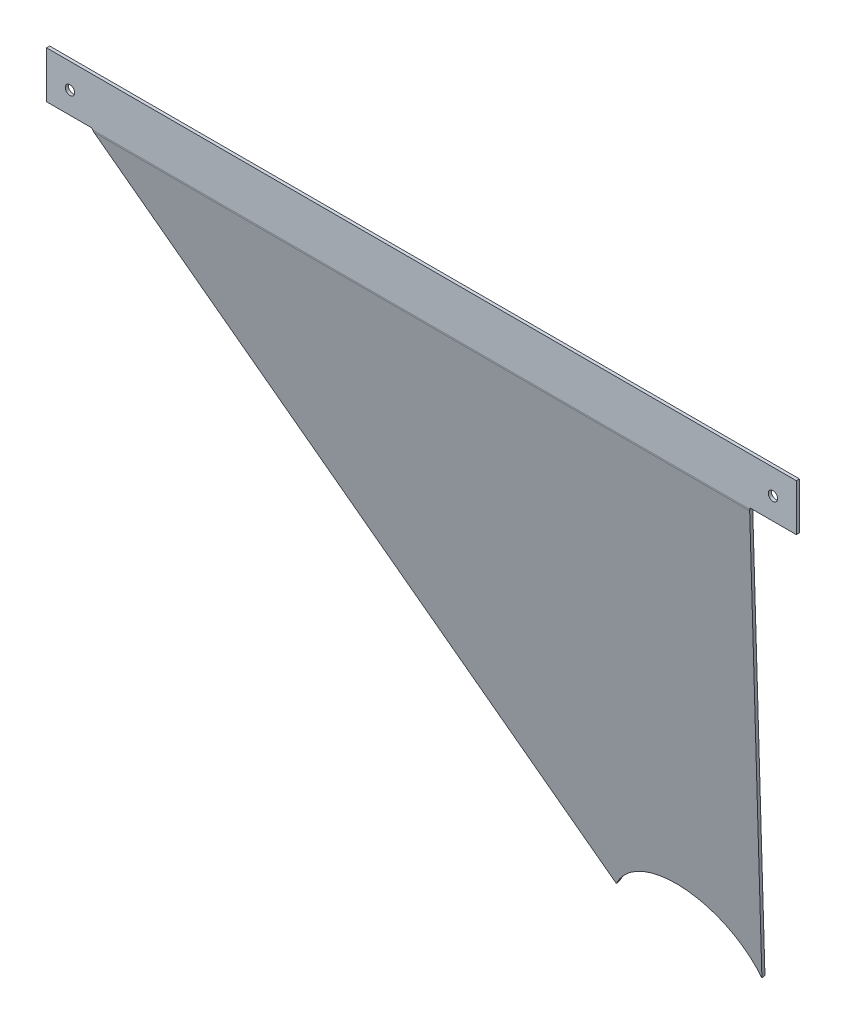
ISO-10303-21;
HEADER;
FILE_DESCRIPTION(('STEP AP214'),'2;1');
FILE_NAME('part.step','',(''),(''),'','','');
FILE_SCHEMA(('AUTOMOTIVE_DESIGN { 1 0 10303 214 1 1 1 1 }'));
ENDSEC;
DATA;
#1=APPLICATION_CONTEXT('core data for automotive mechanical design processes');
#2=APPLICATION_PROTOCOL_DEFINITION('international standard','automotive_design',2000,#1);
#3=PRODUCT_CONTEXT('',#1,'mechanical');
#4=PRODUCT('Part','Part','',(#3));
#5=PRODUCT_RELATED_PRODUCT_CATEGORY('part','',(#4));
#6=PRODUCT_DEFINITION_FORMATION('','',#4);
#7=PRODUCT_DEFINITION_CONTEXT('part definition',#1,'design');
#8=PRODUCT_DEFINITION('design','',#6,#7);
#9=PRODUCT_DEFINITION_SHAPE('','',#8);
#10=(LENGTH_UNIT() NAMED_UNIT(*) SI_UNIT(.MILLI.,.METRE.));
#11=(NAMED_UNIT(*) PLANE_ANGLE_UNIT() SI_UNIT($,.RADIAN.));
#12=(NAMED_UNIT(*) SI_UNIT($,.STERADIAN.) SOLID_ANGLE_UNIT());
#13=UNCERTAINTY_MEASURE_WITH_UNIT(LENGTH_MEASURE(1.E-05),#10,'distance_accuracy_value','');
#14=(GEOMETRIC_REPRESENTATION_CONTEXT(3) GLOBAL_UNCERTAINTY_ASSIGNED_CONTEXT((#13)) GLOBAL_UNIT_ASSIGNED_CONTEXT((#10,
#11,#12)) REPRESENTATION_CONTEXT('',''));
#15=CARTESIAN_POINT('',(0.,0.,0.));
#16=DIRECTION('',(0.,0.,1.));
#17=DIRECTION('',(1.,0.,0.));
#18=AXIS2_PLACEMENT_3D('',#15,#16,#17);
#19=CARTESIAN_POINT('',(210.769042151657,1.02294174943751,212.5));
#20=DIRECTION('',(0.,1.,0.));
#21=DIRECTION('',(1.,0.,0.));
#22=AXIS2_PLACEMENT_3D('',#19,#20,#21);
#23=PLANE('',#22);
#24=DIRECTION('',(0.,0.,1.));
#25=VECTOR('',#24,1.);
#26=CARTESIAN_POINT('',(210.769042151657,1.02294174943751,212.5));
#27=LINE('',#26,#25);
#28=CARTESIAN_POINT('',(210.769042151657,1.02294174943751,210.5));
#29=VERTEX_POINT('',#28);
#30=CARTESIAN_POINT('',(210.769042151657,1.02294174943751,212.5));
#31=VERTEX_POINT('',#30);
#32=EDGE_CURVE('E11',#29,#31,#27,.T.);
#33=ORIENTED_EDGE('',*,*,#32,.F.);
#34=DIRECTION('',(1.,0.,0.));
#35=VECTOR('',#34,1.);
#36=CARTESIAN_POINT('',(95.5157884569474,1.02294174943751,210.5));
#37=LINE('',#36,#35);
#38=CARTESIAN_POINT('',(240.5,1.02294174943751,210.5));
#39=VERTEX_POINT('',#38);
#40=EDGE_CURVE('E149',#29,#39,#37,.T.);
#41=ORIENTED_EDGE('',*,*,#40,.T.);
#42=DIRECTION('',(0.,0.,1.));
#43=VECTOR('',#42,1.);
#44=CARTESIAN_POINT('',(240.5,1.02294174943751,212.5));
#45=LINE('',#44,#43);
#46=CARTESIAN_POINT('',(240.5,1.02294174943751,212.5));
#47=VERTEX_POINT('',#46);
#48=EDGE_CURVE('E55',#39,#47,#45,.T.);
#49=ORIENTED_EDGE('',*,*,#48,.T.);
#50=DIRECTION('',(1.,0.,0.));
#51=VECTOR('',#50,1.);
#52=CARTESIAN_POINT('',(210.769042151657,1.02294174943751,212.5));
#53=LINE('',#52,#51);
#54=EDGE_CURVE('E338',#31,#47,#53,.T.);
#55=ORIENTED_EDGE('',*,*,#54,.F.);
#56=EDGE_LOOP('',(#33,#41,#49,#55));
#57=FACE_BOUND('',#56,.T.);
#58=ADVANCED_FACE('F43',(#57),#23,.F.);
#59=CARTESIAN_POINT('',(240.5,1.02294174943751,212.5));
#60=DIRECTION('',(-1.,0.,0.));
#61=DIRECTION('',(0.,1.,0.));
#62=AXIS2_PLACEMENT_3D('',#59,#60,#61);
#63=PLANE('',#62);
#64=ORIENTED_EDGE('',*,*,#48,.F.);
#65=DIRECTION('',(0.,1.,0.));
#66=VECTOR('',#65,1.);
#67=CARTESIAN_POINT('',(240.5,-357.417912126763,210.5));
#68=LINE('',#67,#66);
#69=CARTESIAN_POINT('',(240.5,31.0229417494375,210.5));
#70=VERTEX_POINT('',#69);
#71=EDGE_CURVE('E392',#39,#70,#68,.T.);
#72=ORIENTED_EDGE('',*,*,#71,.T.);
#73=DIRECTION('',(0.,0.,1.));
#74=VECTOR('',#73,1.);
#75=CARTESIAN_POINT('',(240.5,31.0229417494375,212.5));
#76=LINE('',#75,#74);
#77=CARTESIAN_POINT('',(240.5,31.0229417494375,212.5));
#78=VERTEX_POINT('',#77);
#79=EDGE_CURVE('E442',#70,#78,#76,.T.);
#80=ORIENTED_EDGE('',*,*,#79,.T.);
#81=DIRECTION('',(0.,1.,0.));
#82=VECTOR('',#81,1.);
#83=CARTESIAN_POINT('',(240.5,1.02294174943751,212.5));
#84=LINE('',#83,#82);
#85=EDGE_CURVE('E344',#47,#78,#84,.T.);
#86=ORIENTED_EDGE('',*,*,#85,.F.);
#87=EDGE_LOOP('',(#64,#72,#80,#86));
#88=FACE_BOUND('',#87,.T.);
#89=ADVANCED_FACE('F465',(#88),#63,.F.);
#90=CARTESIAN_POINT('',(-240.5,31.0229417494375,212.5));
#91=DIRECTION('',(0.,-1.,0.));
#92=DIRECTION('',(-1.,0.,0.));
#93=AXIS2_PLACEMENT_3D('',#90,#91,#92);
#94=PLANE('',#93);
#95=ORIENTED_EDGE('',*,*,#79,.F.);
#96=DIRECTION('',(1.,0.,0.));
#97=VECTOR('',#96,1.);
#98=CARTESIAN_POINT('',(95.5157884569474,31.0229417494375,210.5));
#99=LINE('',#98,#97);
#100=CARTESIAN_POINT('',(-240.5,31.0229417494375,210.5));
#101=VERTEX_POINT('',#100);
#102=EDGE_CURVE('E388',#70,#101,#99,.F.);
#103=ORIENTED_EDGE('',*,*,#102,.T.);
#104=DIRECTION('',(0.,0.,1.));
#105=VECTOR('',#104,1.);
#106=CARTESIAN_POINT('',(-240.5,31.0229417494375,212.5));
#107=LINE('',#106,#105);
#108=CARTESIAN_POINT('',(-240.5,31.0229417494375,212.5));
#109=VERTEX_POINT('',#108);
#110=EDGE_CURVE('E439',#101,#109,#107,.T.);
#111=ORIENTED_EDGE('',*,*,#110,.T.);
#112=DIRECTION('',(-1.,0.,0.));
#113=VECTOR('',#112,1.);
#114=CARTESIAN_POINT('',(-240.5,31.0229417494375,212.5));
#115=LINE('',#114,#113);
#116=EDGE_CURVE('E348',#78,#109,#115,.T.);
#117=ORIENTED_EDGE('',*,*,#116,.F.);
#118=EDGE_LOOP('',(#95,#103,#111,#117));
#119=FACE_BOUND('',#118,.T.);
#120=ADVANCED_FACE('F469',(#119),#94,.F.);
#121=CARTESIAN_POINT('',(-240.5,1.02294174943751,212.5));
#122=DIRECTION('',(1.,0.,0.));
#123=DIRECTION('',(0.,-1.,0.));
#124=AXIS2_PLACEMENT_3D('',#121,#122,#123);
#125=PLANE('',#124);
#126=ORIENTED_EDGE('',*,*,#110,.F.);
#127=DIRECTION('',(0.,1.,0.));
#128=VECTOR('',#127,1.);
#129=CARTESIAN_POINT('',(-240.5,-357.417912126763,210.5));
#130=LINE('',#129,#128);
#131=CARTESIAN_POINT('',(-240.5,1.02294174943751,210.5));
#132=VERTEX_POINT('',#131);
#133=EDGE_CURVE('E384',#101,#132,#130,.F.);
#134=ORIENTED_EDGE('',*,*,#133,.T.);
#135=DIRECTION('',(0.,0.,1.));
#136=VECTOR('',#135,1.);
#137=CARTESIAN_POINT('',(-240.5,1.02294174943751,212.5));
#138=LINE('',#137,#136);
#139=CARTESIAN_POINT('',(-240.5,1.02294174943751,212.5));
#140=VERTEX_POINT('',#139);
#141=EDGE_CURVE('E436',#132,#140,#138,.T.);
#142=ORIENTED_EDGE('',*,*,#141,.T.);
#143=DIRECTION('',(0.,-1.,0.));
#144=VECTOR('',#143,1.);
#145=CARTESIAN_POINT('',(-240.5,1.02294174943751,212.5));
#146=LINE('',#145,#144);
#147=EDGE_CURVE('E352',#109,#140,#146,.T.);
#148=ORIENTED_EDGE('',*,*,#147,.F.);
#149=EDGE_LOOP('',(#126,#134,#142,#148));
#150=FACE_BOUND('',#149,.T.);
#151=ADVANCED_FACE('F470',(#150),#125,.F.);
#152=CARTESIAN_POINT('',(-240.5,1.02294174943751,212.5));
#153=DIRECTION('',(0.,1.,0.));
#154=DIRECTION('',(1.,0.,0.));
#155=AXIS2_PLACEMENT_3D('',#152,#153,#154);
#156=PLANE('',#155);
#157=ORIENTED_EDGE('',*,*,#141,.F.);
#158=DIRECTION('',(1.,0.,0.));
#159=VECTOR('',#158,1.);
#160=CARTESIAN_POINT('',(95.5157884569474,1.02294174943751,210.5));
#161=LINE('',#160,#159);
#162=CARTESIAN_POINT('',(-211.57084579179,1.02294174943751,210.5));
#163=VERTEX_POINT('',#162);
#164=EDGE_CURVE('E158',#132,#163,#161,.T.);
#165=ORIENTED_EDGE('',*,*,#164,.T.);
#166=DIRECTION('',(0.,0.,1.));
#167=VECTOR('',#166,1.);
#168=CARTESIAN_POINT('',(-211.57084579179,1.02294174943751,212.5));
#169=LINE('',#168,#167);
#170=CARTESIAN_POINT('',(-211.57084579179,1.02294174943751,212.5));
#171=VERTEX_POINT('',#170);
#172=EDGE_CURVE('E64',#163,#171,#169,.T.);
#173=ORIENTED_EDGE('',*,*,#172,.T.);
#174=DIRECTION('',(1.,0.,0.));
#175=VECTOR('',#174,1.);
#176=CARTESIAN_POINT('',(-240.5,1.02294174943751,212.5));
#177=LINE('',#176,#175);
#178=EDGE_CURVE('E293',#140,#171,#177,.T.);
#179=ORIENTED_EDGE('',*,*,#178,.F.);
#180=EDGE_LOOP('',(#157,#165,#173,#179));
#181=FACE_BOUND('',#180,.T.);
#182=ADVANCED_FACE('F435',(#181),#156,.F.);
#183=CARTESIAN_POINT('',(51.4895405271296,-332.10810287253,212.5));
#184=DIRECTION('',(0.784811501236738,0.61973454601671,0.));
#185=DIRECTION('',(0.61973454601671,-0.784811501236738,0.));
#186=AXIS2_PLACEMENT_3D('',#183,#184,#185);
#187=PLANE('',#186);
#188=ORIENTED_EDGE('',*,*,#172,.F.);
#189=DIRECTION('',(0.61973454601671,-0.784811501236738,0.));
#190=VECTOR('',#189,1.);
#191=CARTESIAN_POINT('',(51.4895405271296,-332.10810287253,210.5));
#192=LINE('',#191,#190);
#193=CARTESIAN_POINT('',(-210.949075890748,0.235552741359223,210.5));
#194=VERTEX_POINT('',#193);
#195=EDGE_CURVE('E145',#163,#194,#192,.T.);
#196=ORIENTED_EDGE('',*,*,#195,.T.);
#197=CARTESIAN_POINT('',(-210.949075890748,0.23555274135917,212.5));
#198=CARTESIAN_POINT('',(-210.949075890748,0.235552741359193,210.5));
#199=B_SPLINE_CURVE_WITH_KNOTS('',1,(#197,#198),.UNSPECIFIED.,.F.,.F.,(2,2),(0.,1.),.UNSPECIFIED.);
#200=CARTESIAN_POINT('',(-210.949075890748,0.235552741359224,212.5));
#201=VERTEX_POINT('',#200);
#202=EDGE_CURVE('E431',#194,#201,#199,.F.);
#203=ORIENTED_EDGE('',*,*,#202,.T.);
#204=DIRECTION('',(0.61973454601671,-0.784811501236738,0.));
#205=VECTOR('',#204,1.);
#206=CARTESIAN_POINT('',(51.4895405271296,-332.10810287253,212.5));
#207=LINE('',#206,#205);
#208=EDGE_CURVE('E325',#171,#201,#207,.T.);
#209=ORIENTED_EDGE('',*,*,#208,.F.);
#210=EDGE_LOOP('',(#188,#196,#203,#209));
#211=FACE_BOUND('',#210,.T.);
#212=ADVANCED_FACE('F234',(#211),#187,.F.);
#213=CARTESIAN_POINT('',(-210.949075890748,0.23555274135917,212.5));
#214=CARTESIAN_POINT('',(-210.737370616322,-0.107015156113455,212.5));
#215=CARTESIAN_POINT('',(-210.525698607857,-0.449515483664102,212.461582432823));
#216=CARTESIAN_POINT('',(-210.313993333431,-0.783570347690304,212.385687029806));
#217=CARTESIAN_POINT('',(-210.949075890748,0.235552741359193,210.5));
#218=CARTESIAN_POINT('',(-210.737374589646,0.0419310420015715,210.5));
#219=CARTESIAN_POINT('',(-210.525694634533,-0.151663277343385,210.478284917794));
#220=CARTESIAN_POINT('',(-210.313993333431,-0.340473352451379,210.435388321194));
#221=B_SPLINE_SURFACE_WITH_KNOTS('',1,3,((#213,#214,#215,#216),(#217,#218,#219,#220)),
.UNSPECIFIED.,.F.,.F.,.F.,(2,2),(4,4),(0.,1.),(0.,1.),.UNSPECIFIED.);
#222=CARTESIAN_POINT('',(-210.949075890748,0.235552741359193,210.5));
#223=CARTESIAN_POINT('',(-210.737374589646,0.0419310420015715,210.5));
#224=CARTESIAN_POINT('',(-210.525694634533,-0.151663277343385,210.478284917794));
#225=CARTESIAN_POINT('',(-210.313993333431,-0.340473352451379,210.435388321194));
#226=B_SPLINE_CURVE_WITH_KNOTS('',3,(#222,#223,#224,#225),.UNSPECIFIED.,.F.,.F.,(4,4),(0.,1.),.UNSPECIFIED.);
#227=CARTESIAN_POINT('',(-210.313993333431,-0.340473352451354,210.435388321194));
#228=VERTEX_POINT('',#227);
#229=EDGE_CURVE('E139',#194,#228,#226,.T.);
#230=CARTESIAN_POINT('',(-210.313993333431,-0.340473352451379,210.435388321194));
#231=CARTESIAN_POINT('',(-210.313993333431,-0.783570347690304,212.385687029806));
#232=B_SPLINE_CURVE_WITH_KNOTS('',1,(#230,#231),.UNSPECIFIED.,.F.,.F.,(2,2),(0.,1.),.UNSPECIFIED.);
#233=CARTESIAN_POINT('',(-210.313993333431,-0.783570347690277,212.385687029806));
#234=VERTEX_POINT('',#233);
#235=EDGE_CURVE('E211',#228,#234,#232,.T.);
#236=CARTESIAN_POINT('',(-210.313993333431,-0.783570347690304,212.385687029806));
#237=CARTESIAN_POINT('',(-210.525698607857,-0.449515483664102,212.461582432823));
#238=CARTESIAN_POINT('',(-210.737370616322,-0.107015156113455,212.5));
#239=CARTESIAN_POINT('',(-210.949075890748,0.23555274135917,212.5));
#240=B_SPLINE_CURVE_WITH_KNOTS('',3,(#236,#237,#238,#239),.UNSPECIFIED.,.F.,.F.,(4,4),(0.,1.),.UNSPECIFIED.);
#241=EDGE_CURVE('E126',#201,#234,#240,.F.);
#242=ORIENTED_EDGE('',*,*,#202,.F.);
#243=ORIENTED_EDGE('',*,*,#229,.T.);
#244=ORIENTED_EDGE('',*,*,#235,.T.);
#245=ORIENTED_EDGE('',*,*,#241,.F.);
#246=EDGE_LOOP('',(#242,#243,#244,#245));
#247=FACE_BOUND('',#246,.T.);
#248=ADVANCED_FACE('F221',(#247),#221,.T.);
#249=CARTESIAN_POINT('',(51.4895405271296,-324.084009882929,138.933629309116));
#250=DIRECTION('',(0.784811501236738,0.604333742389046,0.137301257592885));
#251=DIRECTION('',(0.61973454601671,-0.765308428682585,-0.173873809013478));
#252=AXIS2_PLACEMENT_3D('',#249,#250,#251);
#253=PLANE('',#252);
#254=ORIENTED_EDGE('',*,*,#235,.F.);
#255=DIRECTION('',(0.61973454601671,-0.765308428682585,-0.173873809013478));
#256=VECTOR('',#255,1.);
#257=CARTESIAN_POINT('',(51.4895405271296,-323.64091288769,136.983330600505));
#258=LINE('',#257,#256);
#259=CARTESIAN_POINT('',(51.4895405271297,-323.64091288769,136.983330600505));
#260=VERTEX_POINT('',#259);
#261=EDGE_CURVE('E409',#228,#260,#258,.T.);
#262=ORIENTED_EDGE('',*,*,#261,.T.);
#263=DIRECTION('',(0.,-0.221548497619468,0.975149354305563));
#264=VECTOR('',#263,1.);
#265=CARTESIAN_POINT('',(51.4895405271296,-324.084009882929,138.933629309116));
#266=LINE('',#265,#264);
#267=CARTESIAN_POINT('',(51.4895405271296,-324.084009882929,138.933629309116));
#268=VERTEX_POINT('',#267);
#269=EDGE_CURVE('E208',#260,#268,#266,.T.);
#270=ORIENTED_EDGE('',*,*,#269,.T.);
#271=DIRECTION('',(0.61973454601671,-0.765308428682585,-0.173873809013478));
#272=VECTOR('',#271,1.);
#273=CARTESIAN_POINT('',(51.4895405271296,-324.084009882929,138.933629309116));
#274=LINE('',#273,#272);
#275=EDGE_CURVE('E299',#234,#268,#274,.T.);
#276=ORIENTED_EDGE('',*,*,#275,.F.);
#277=EDGE_LOOP('',(#254,#262,#270,#276));
#278=FACE_BOUND('',#277,.T.);
#279=ADVANCED_FACE('F233',(#278),#253,.F.);
#280=CARTESIAN_POINT('',(95.5157884569474,-348.764854034791,133.326279093805));
#281=DIRECTION('',(0.,0.221548497619468,-0.975149354305563));
#282=DIRECTION('',(0.,0.975149354305563,0.221548497619468));
#283=AXIS2_PLACEMENT_3D('',#280,#281,#282);
#284=CYLINDRICAL_SURFACE('',#283,50.7828411105899);
#285=ORIENTED_EDGE('',*,*,#269,.F.);
#286=CARTESIAN_POINT('',(95.5157884569474,-348.321757039552,131.375980385194));
#287=DIRECTION('',(0.,0.221548497619468,-0.975149354305563));
#288=DIRECTION('',(0.,0.975149354305563,0.221548497619468));
#289=AXIS2_PLACEMENT_3D('',#286,#287,#288);
#290=CIRCLE('',#289,50.7828411105899);
#291=CARTESIAN_POINT('',(143.148777253658,-331.152610281734,135.276714824291));
#292=VERTEX_POINT('',#291);
#293=EDGE_CURVE('E362',#260,#292,#290,.T.);
#294=ORIENTED_EDGE('',*,*,#293,.T.);
#295=DIRECTION('',(0.,-0.221548497619468,0.975149354305563));
#296=VECTOR('',#295,1.);
#297=CARTESIAN_POINT('',(143.148777253658,-331.595707276974,137.227013532902));
#298=LINE('',#297,#296);
#299=CARTESIAN_POINT('',(143.148777253658,-331.595707276974,137.227013532902));
#300=VERTEX_POINT('',#299);
#301=EDGE_CURVE('E200',#292,#300,#298,.T.);
#302=ORIENTED_EDGE('',*,*,#301,.T.);
#303=CARTESIAN_POINT('',(95.5157884569474,-348.764854034791,133.326279093805));
#304=DIRECTION('',(0.,0.221548497619468,-0.975149354305563));
#305=DIRECTION('',(0.,0.975149354305563,0.221548497619468));
#306=AXIS2_PLACEMENT_3D('',#303,#304,#305);
#307=CIRCLE('',#306,50.7828411105899);
#308=EDGE_CURVE('E284',#268,#300,#307,.T.);
#309=ORIENTED_EDGE('',*,*,#308,.F.);
#310=EDGE_LOOP('',(#285,#294,#302,#309));
#311=FACE_BOUND('',#310,.T.);
#312=ADVANCED_FACE('F539',(#311),#284,.F.);
#313=CARTESIAN_POINT('',(210.769042151657,0.768513179320141,212.738311755516));
#314=DIRECTION('',(-0.980882002254504,0.189767415838435,0.0431140990767246));
#315=DIRECTION('',(0.19460343689975,0.956506451148428,0.217312933941461));
#316=AXIS2_PLACEMENT_3D('',#313,#314,#315);
#317=PLANE('',#316);
#318=ORIENTED_EDGE('',*,*,#301,.F.);
#319=DIRECTION('',(0.19460343689975,0.956506451148428,0.217312933941461));
#320=VECTOR('',#319,1.);
#321=CARTESIAN_POINT('',(210.769042151657,1.21161017455908,210.788013046905));
#322=LINE('',#321,#320);
#323=CARTESIAN_POINT('',(210.453267189189,-0.340473352451457,210.435388321194));
#324=VERTEX_POINT('',#323);
#325=EDGE_CURVE('E273',#292,#324,#322,.T.);
#326=ORIENTED_EDGE('',*,*,#325,.T.);
#327=CARTESIAN_POINT('',(210.453267189189,-0.783570347690402,212.385687029806));
#328=CARTESIAN_POINT('',(210.453267189189,-0.340473352451465,210.435388321194));
#329=B_SPLINE_CURVE_WITH_KNOTS('',1,(#327,#328),.UNSPECIFIED.,.F.,.F.,(2,2),(0.,1.),.UNSPECIFIED.);
#330=CARTESIAN_POINT('',(210.453267189189,-0.783570347690388,212.385687029806));
#331=VERTEX_POINT('',#330);
#332=EDGE_CURVE('E125',#324,#331,#329,.F.);
#333=ORIENTED_EDGE('',*,*,#332,.T.);
#334=DIRECTION('',(0.19460343689975,0.956506451148428,0.217312933941461));
#335=VECTOR('',#334,1.);
#336=CARTESIAN_POINT('',(210.769042151657,0.768513179320141,212.738311755516));
#337=LINE('',#336,#335);
#338=EDGE_CURVE('E271',#300,#331,#337,.T.);
#339=ORIENTED_EDGE('',*,*,#338,.F.);
#340=EDGE_LOOP('',(#318,#326,#333,#339));
#341=FACE_BOUND('',#340,.T.);
#342=ADVANCED_FACE('F182',(#341),#317,.F.);
#343=CARTESIAN_POINT('',(210.453267189189,-0.783570347690402,212.385687029806));
#344=CARTESIAN_POINT('',(210.506457493728,-0.449509787423095,212.461583726978));
#345=CARTESIAN_POINT('',(210.559636719511,-0.107020997517169,212.5));
#346=CARTESIAN_POINT('',(210.61282702405,0.23555274135915,212.5));
#347=CARTESIAN_POINT('',(210.453267189189,-0.340473352451465,210.435388321194));
#348=CARTESIAN_POINT('',(210.506457328881,-0.151657099218828,210.478286321429));
#349=CARTESIAN_POINT('',(210.559636884358,0.0419247064340883,210.5));
#350=CARTESIAN_POINT('',(210.61282702405,0.23555274135915,210.5));
#351=B_SPLINE_SURFACE_WITH_KNOTS('',1,3,((#343,#344,#345,#346),(#347,#348,#349,#350)),
.UNSPECIFIED.,.F.,.F.,.F.,(2,2),(4,4),(0.,1.),(0.,1.),.UNSPECIFIED.);
#352=CARTESIAN_POINT('',(210.453267189189,-0.340473352451465,210.435388321194));
#353=CARTESIAN_POINT('',(210.506457328881,-0.151657099218828,210.478286321429));
#354=CARTESIAN_POINT('',(210.559636884358,0.0419247064340883,210.5));
#355=CARTESIAN_POINT('',(210.61282702405,0.23555274135915,210.5));
#356=B_SPLINE_CURVE_WITH_KNOTS('',3,(#352,#353,#354,#355),.UNSPECIFIED.,.F.,.F.,(4,4),(0.,1.),.UNSPECIFIED.);
#357=CARTESIAN_POINT('',(210.61282702405,0.235552741359225,210.5));
#358=VERTEX_POINT('',#357);
#359=EDGE_CURVE('E135',#324,#358,#356,.T.);
#360=CARTESIAN_POINT('',(210.61282702405,0.23555274135915,210.5));
#361=CARTESIAN_POINT('',(210.61282702405,0.23555274135915,212.5));
#362=B_SPLINE_CURVE_WITH_KNOTS('',1,(#360,#361),.UNSPECIFIED.,.F.,.F.,(2,2),(0.,1.),.UNSPECIFIED.);
#363=CARTESIAN_POINT('',(210.61282702405,0.235552741359224,212.5));
#364=VERTEX_POINT('',#363);
#365=EDGE_CURVE('E111',#358,#364,#362,.T.);
#366=CARTESIAN_POINT('',(210.61282702405,0.23555274135915,212.5));
#367=CARTESIAN_POINT('',(210.559636719511,-0.107020997517169,212.5));
#368=CARTESIAN_POINT('',(210.506457493728,-0.449509787423095,212.461583726978));
#369=CARTESIAN_POINT('',(210.453267189189,-0.783570347690402,212.385687029806));
#370=B_SPLINE_CURVE_WITH_KNOTS('',3,(#366,#367,#368,#369),.UNSPECIFIED.,.F.,.F.,(4,4),(0.,1.),.UNSPECIFIED.);
#371=EDGE_CURVE('E288',#331,#364,#370,.F.);
#372=ORIENTED_EDGE('',*,*,#332,.F.);
#373=ORIENTED_EDGE('',*,*,#359,.T.);
#374=ORIENTED_EDGE('',*,*,#365,.T.);
#375=ORIENTED_EDGE('',*,*,#371,.F.);
#376=EDGE_LOOP('',(#372,#373,#374,#375));
#377=FACE_BOUND('',#376,.T.);
#378=ADVANCED_FACE('F153',(#377),#351,.T.);
#379=CARTESIAN_POINT('',(-225.5,15.,212.5));
#380=DIRECTION('',(0.,0.,-1.));
#381=DIRECTION('',(-1.,0.,0.));
#382=AXIS2_PLACEMENT_3D('',#379,#380,#381);
#383=CYLINDRICAL_SURFACE('',#382,2.99999999999999);
#384=CARTESIAN_POINT('',(-225.5,15.,212.5));
#385=DIRECTION('',(0.,0.,-1.));
#386=DIRECTION('',(-1.,0.,0.));
#387=AXIS2_PLACEMENT_3D('',#384,#385,#386);
#388=CIRCLE('',#387,2.99999999999999);
#389=CARTESIAN_POINT('',(-228.5,15.,212.5));
#390=VERTEX_POINT('',#389);
#391=EDGE_CURVE('E286',#390,#390,#388,.T.);
#392=ORIENTED_EDGE('',*,*,#391,.F.);
#393=EDGE_LOOP('',(#392));
#394=FACE_BOUND('',#393,.T.);
#395=CARTESIAN_POINT('',(-225.5,15.,210.5));
#396=DIRECTION('',(0.,0.,-1.));
#397=DIRECTION('',(-1.,0.,0.));
#398=AXIS2_PLACEMENT_3D('',#395,#396,#397);
#399=CIRCLE('',#398,2.99999999999999);
#400=CARTESIAN_POINT('',(-228.5,15.,210.5));
#401=VERTEX_POINT('',#400);
#402=EDGE_CURVE('E398',#401,#401,#399,.T.);
#403=ORIENTED_EDGE('',*,*,#402,.T.);
#404=EDGE_LOOP('',(#403));
#405=FACE_BOUND('',#404,.T.);
#406=ADVANCED_FACE('F181',(#394,#405),#383,.F.);
#407=CARTESIAN_POINT('',(225.5,15.,212.5));
#408=DIRECTION('',(0.,0.,-1.));
#409=DIRECTION('',(-1.,0.,0.));
#410=AXIS2_PLACEMENT_3D('',#407,#408,#409);
#411=CYLINDRICAL_SURFACE('',#410,2.99999999999999);
#412=CARTESIAN_POINT('',(225.5,15.,212.5));
#413=DIRECTION('',(0.,0.,-1.));
#414=DIRECTION('',(-1.,0.,0.));
#415=AXIS2_PLACEMENT_3D('',#412,#413,#414);
#416=CIRCLE('',#415,2.99999999999999);
#417=CARTESIAN_POINT('',(222.5,15.,212.5));
#418=VERTEX_POINT('',#417);
#419=EDGE_CURVE('E321',#418,#418,#416,.T.);
#420=ORIENTED_EDGE('',*,*,#419,.F.);
#421=EDGE_LOOP('',(#420));
#422=FACE_BOUND('',#421,.T.);
#423=CARTESIAN_POINT('',(225.5,15.,210.5));
#424=DIRECTION('',(0.,0.,-1.));
#425=DIRECTION('',(-1.,0.,0.));
#426=AXIS2_PLACEMENT_3D('',#423,#424,#425);
#427=CIRCLE('',#426,2.99999999999999);
#428=CARTESIAN_POINT('',(222.5,15.,210.5));
#429=VERTEX_POINT('',#428);
#430=EDGE_CURVE('E402',#429,#429,#427,.T.);
#431=ORIENTED_EDGE('',*,*,#430,.T.);
#432=EDGE_LOOP('',(#431));
#433=FACE_BOUND('',#432,.T.);
#434=ADVANCED_FACE('F45',(#422,#433),#411,.F.);
#435=CARTESIAN_POINT('',(210.769042151657,1.02294174943751,212.5));
#436=DIRECTION('',(-0.980882002254504,0.19460343689975,0.));
#437=DIRECTION('',(0.19460343689975,0.980882002254504,0.));
#438=AXIS2_PLACEMENT_3D('',#435,#436,#437);
#439=PLANE('',#438);
#440=DIRECTION('',(0.19460343689975,0.980882002254504,0.));
#441=VECTOR('',#440,1.);
#442=CARTESIAN_POINT('',(210.769042151657,1.02294174943751,210.5));
#443=LINE('',#442,#441);
#444=EDGE_CURVE('E115',#358,#29,#443,.T.);
#445=ORIENTED_EDGE('',*,*,#444,.T.);
#446=ORIENTED_EDGE('',*,*,#32,.T.);
#447=DIRECTION('',(0.19460343689975,0.980882002254504,0.));
#448=VECTOR('',#447,1.);
#449=CARTESIAN_POINT('',(210.769042151657,1.02294174943751,212.5));
#450=LINE('',#449,#448);
#451=EDGE_CURVE('E118',#364,#31,#450,.T.);
#452=ORIENTED_EDGE('',*,*,#451,.F.);
#453=ORIENTED_EDGE('',*,*,#365,.F.);
#454=EDGE_LOOP('',(#445,#446,#452,#453));
#455=FACE_BOUND('',#454,.T.);
#456=ADVANCED_FACE('F113',(#455),#439,.F.);
#457=CARTESIAN_POINT('',(421.63869985761,0.235552741359113,207.9));
#458=DIRECTION('',(-1.,0.,0.));
#459=DIRECTION('',(0.,-1.,0.));
#460=AXIS2_PLACEMENT_3D('',#457,#458,#459);
#461=CYLINDRICAL_SURFACE('',#460,4.6);
#462=DIRECTION('',(1.,0.,0.));
#463=VECTOR('',#462,1.);
#464=CARTESIAN_POINT('',(95.5157884569475,-0.783570347690388,212.385687029806));
#465=LINE('',#464,#463);
#466=EDGE_CURVE('E282',#234,#331,#465,.T.);
#467=ORIENTED_EDGE('',*,*,#466,.T.);
#468=ORIENTED_EDGE('',*,*,#371,.T.);
#469=DIRECTION('',(1.,0.,0.));
#470=VECTOR('',#469,1.);
#471=CARTESIAN_POINT('',(95.5157884569474,0.235552741359224,212.5));
#472=LINE('',#471,#470);
#473=EDGE_CURVE('E329',#201,#364,#472,.T.);
#474=ORIENTED_EDGE('',*,*,#473,.F.);
#475=ORIENTED_EDGE('',*,*,#241,.T.);
#476=EDGE_LOOP('',(#467,#468,#474,#475));
#477=FACE_BOUND('',#476,.T.);
#478=ADVANCED_FACE('F296',(#477),#461,.T.);
#479=CARTESIAN_POINT('',(95.5157884569474,-357.417912126763,212.5));
#480=DIRECTION('',(0.,0.,-1.));
#481=DIRECTION('',(0.,1.,0.));
#482=AXIS2_PLACEMENT_3D('',#479,#480,#481);
#483=PLANE('',#482);
#484=ORIENTED_EDGE('',*,*,#391,.T.);
#485=EDGE_LOOP('',(#484));
#486=FACE_BOUND('',#485,.T.);
#487=ORIENTED_EDGE('',*,*,#419,.T.);
#488=EDGE_LOOP('',(#487));
#489=FACE_BOUND('',#488,.T.);
#490=ORIENTED_EDGE('',*,*,#208,.T.);
#491=ORIENTED_EDGE('',*,*,#473,.T.);
#492=ORIENTED_EDGE('',*,*,#451,.T.);
#493=ORIENTED_EDGE('',*,*,#54,.T.);
#494=ORIENTED_EDGE('',*,*,#85,.T.);
#495=ORIENTED_EDGE('',*,*,#116,.T.);
#496=ORIENTED_EDGE('',*,*,#147,.T.);
#497=ORIENTED_EDGE('',*,*,#178,.T.);
#498=EDGE_LOOP('',(#490,#491,#492,#493,#494,#495,#496,#497));
#499=FACE_BOUND('',#498,.T.);
#500=ADVANCED_FACE('F463',(#486,#489,#499),#483,.F.);
#501=CARTESIAN_POINT('',(95.5157884569474,-348.764854034791,133.326279093805));
#502=DIRECTION('',(0.,0.221548497619468,-0.975149354305563));
#503=DIRECTION('',(0.,0.975149354305563,0.221548497619468));
#504=AXIS2_PLACEMENT_3D('',#501,#502,#503);
#505=PLANE('',#504);
#506=ORIENTED_EDGE('',*,*,#466,.F.);
#507=ORIENTED_EDGE('',*,*,#275,.T.);
#508=ORIENTED_EDGE('',*,*,#308,.T.);
#509=ORIENTED_EDGE('',*,*,#338,.T.);
#510=EDGE_LOOP('',(#506,#507,#508,#509));
#511=FACE_BOUND('',#510,.T.);
#512=ADVANCED_FACE('F279',(#511),#505,.F.);
#513=CARTESIAN_POINT('',(421.63869985761,0.235552741359113,207.9));
#514=DIRECTION('',(-1.,0.,0.));
#515=DIRECTION('',(0.,-1.,0.));
#516=AXIS2_PLACEMENT_3D('',#513,#514,#515);
#517=CYLINDRICAL_SURFACE('',#516,2.6);
#518=DIRECTION('',(-1.,0.,0.));
#519=VECTOR('',#518,1.);
#520=CARTESIAN_POINT('',(421.63869985761,-0.340473352451505,210.435388321194));
#521=LINE('',#520,#519);
#522=EDGE_CURVE('E406',#228,#324,#521,.F.);
#523=ORIENTED_EDGE('',*,*,#522,.F.);
#524=ORIENTED_EDGE('',*,*,#229,.F.);
#525=DIRECTION('',(1.,0.,0.));
#526=VECTOR('',#525,1.);
#527=CARTESIAN_POINT('',(95.5157884569474,0.235552741359224,210.5));
#528=LINE('',#527,#526);
#529=EDGE_CURVE('E132',#194,#358,#528,.T.);
#530=ORIENTED_EDGE('',*,*,#529,.T.);
#531=ORIENTED_EDGE('',*,*,#359,.F.);
#532=EDGE_LOOP('',(#523,#524,#530,#531));
#533=FACE_BOUND('',#532,.T.);
#534=ADVANCED_FACE('F134',(#533),#517,.F.);
#535=CARTESIAN_POINT('',(95.5157884569474,-357.417912126763,210.5));
#536=DIRECTION('',(0.,0.,-1.));
#537=DIRECTION('',(0.,1.,0.));
#538=AXIS2_PLACEMENT_3D('',#535,#536,#537);
#539=PLANE('',#538);
#540=ORIENTED_EDGE('',*,*,#402,.F.);
#541=EDGE_LOOP('',(#540));
#542=FACE_BOUND('',#541,.T.);
#543=ORIENTED_EDGE('',*,*,#430,.F.);
#544=EDGE_LOOP('',(#543));
#545=FACE_BOUND('',#544,.T.);
#546=ORIENTED_EDGE('',*,*,#195,.F.);
#547=ORIENTED_EDGE('',*,*,#164,.F.);
#548=ORIENTED_EDGE('',*,*,#133,.F.);
#549=ORIENTED_EDGE('',*,*,#102,.F.);
#550=ORIENTED_EDGE('',*,*,#71,.F.);
#551=ORIENTED_EDGE('',*,*,#40,.F.);
#552=ORIENTED_EDGE('',*,*,#444,.F.);
#553=ORIENTED_EDGE('',*,*,#529,.F.);
#554=EDGE_LOOP('',(#546,#547,#548,#549,#550,#551,#552,#553));
#555=FACE_BOUND('',#554,.T.);
#556=ADVANCED_FACE('F147',(#542,#545,#555),#539,.T.);
#557=CARTESIAN_POINT('',(95.5157884569474,-348.321757039552,131.375980385194));
#558=DIRECTION('',(0.,0.221548497619468,-0.975149354305563));
#559=DIRECTION('',(0.,0.975149354305563,0.221548497619468));
#560=AXIS2_PLACEMENT_3D('',#557,#558,#559);
#561=PLANE('',#560);
#562=ORIENTED_EDGE('',*,*,#522,.T.);
#563=ORIENTED_EDGE('',*,*,#325,.F.);
#564=ORIENTED_EDGE('',*,*,#293,.F.);
#565=ORIENTED_EDGE('',*,*,#261,.F.);
#566=EDGE_LOOP('',(#562,#563,#564,#565));
#567=FACE_BOUND('',#566,.T.);
#568=ADVANCED_FACE('F183',(#567),#561,.T.);
#569=CLOSED_SHELL('',(#58,#89,#120,#151,#182,#212,#248,#279,#312,#342,#378,#406,#434,#456,#478,
#500,#512,#534,#556,#568));
#570=MANIFOLD_SOLID_BREP('B2',#569);
#571=ADVANCED_BREP_SHAPE_REPRESENTATION('',(#18,#570),#14);
#572=SHAPE_DEFINITION_REPRESENTATION(#9,#571);
ENDSEC;
END-ISO-10303-21;
